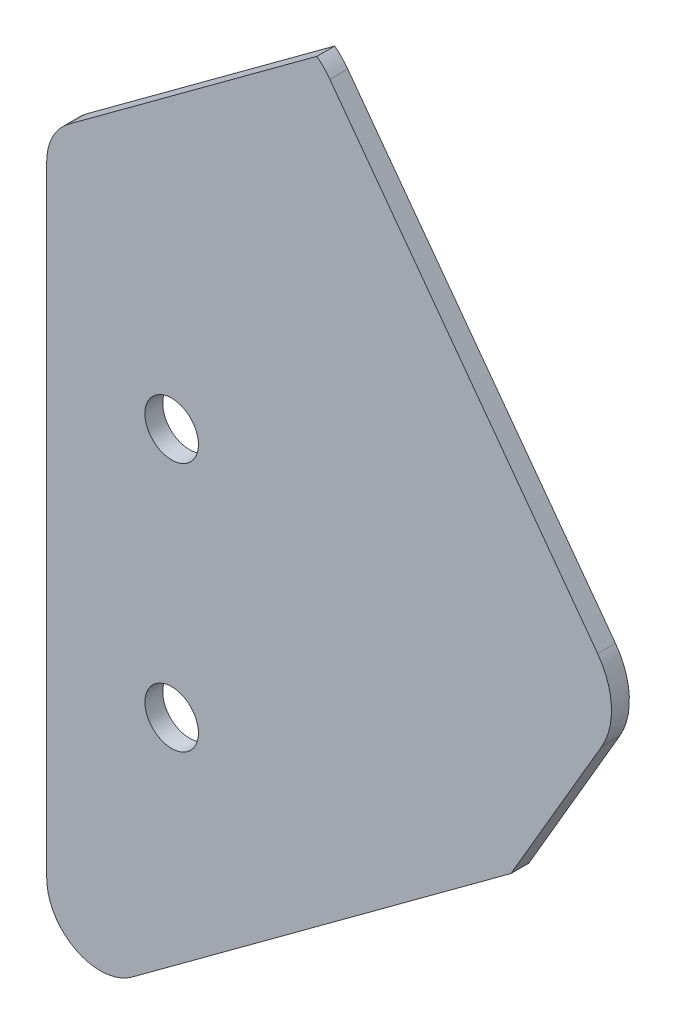
ISO-10303-21;
HEADER;
FILE_DESCRIPTION(('STEP AP214'),'2;1');
FILE_NAME('part.step','',(''),(''),'','','');
FILE_SCHEMA(('AUTOMOTIVE_DESIGN { 1 0 10303 214 1 1 1 1 }'));
ENDSEC;
DATA;
#1=APPLICATION_CONTEXT('core data for automotive mechanical design processes');
#2=APPLICATION_PROTOCOL_DEFINITION('international standard','automotive_design',2000,#1);
#3=PRODUCT_CONTEXT('',#1,'mechanical');
#4=PRODUCT('Part','Part','',(#3));
#5=PRODUCT_RELATED_PRODUCT_CATEGORY('part','',(#4));
#6=PRODUCT_DEFINITION_FORMATION('','',#4);
#7=PRODUCT_DEFINITION_CONTEXT('part definition',#1,'design');
#8=PRODUCT_DEFINITION('design','',#6,#7);
#9=PRODUCT_DEFINITION_SHAPE('','',#8);
#10=(LENGTH_UNIT() NAMED_UNIT(*) SI_UNIT(.MILLI.,.METRE.));
#11=(NAMED_UNIT(*) PLANE_ANGLE_UNIT() SI_UNIT($,.RADIAN.));
#12=(NAMED_UNIT(*) SI_UNIT($,.STERADIAN.) SOLID_ANGLE_UNIT());
#13=UNCERTAINTY_MEASURE_WITH_UNIT(LENGTH_MEASURE(1.E-05),#10,'distance_accuracy_value','');
#14=(GEOMETRIC_REPRESENTATION_CONTEXT(3) GLOBAL_UNCERTAINTY_ASSIGNED_CONTEXT((#13)) GLOBAL_UNIT_ASSIGNED_CONTEXT((#10,
#11,#12)) REPRESENTATION_CONTEXT('',''));
#15=CARTESIAN_POINT('',(0.,0.,0.));
#16=DIRECTION('',(0.,0.,1.));
#17=DIRECTION('',(1.,0.,0.));
#18=AXIS2_PLACEMENT_3D('',#15,#16,#17);
#19=CARTESIAN_POINT('',(-177.829938183927,241.418564799747,3.175));
#20=DIRECTION('',(0.593074905688179,-0.805147288539779,0.));
#21=DIRECTION('',(0.805147288539779,0.593074905688179,0.));
#22=AXIS2_PLACEMENT_3D('',#19,#20,#21);
#23=PLANE('',#22);
#24=DIRECTION('',(-0.805147288539779,-0.593074905688179,0.));
#25=VECTOR('',#24,1.);
#26=CARTESIAN_POINT('',(-177.829938183927,241.418564799747,0.));
#27=LINE('',#26,#25);
#28=CARTESIAN_POINT('',(61.4005319559519,417.636743182071,0.));
#29=VERTEX_POINT('',#28);
#30=CARTESIAN_POINT('',(17.2109615233494,385.086518285645,0.));
#31=VERTEX_POINT('',#30);
#32=EDGE_CURVE('E143',#29,#31,#27,.T.);
#33=ORIENTED_EDGE('',*,*,#32,.T.);
#34=DIRECTION('',(0.,0.,-1.));
#35=VECTOR('',#34,1.);
#36=CARTESIAN_POINT('',(17.2109615233494,385.086518285645,3.175));
#37=LINE('',#36,#35);
#38=CARTESIAN_POINT('',(17.2109615233494,385.086518285645,3.175));
#39=VERTEX_POINT('',#38);
#40=EDGE_CURVE('E11',#39,#31,#37,.T.);
#41=ORIENTED_EDGE('',*,*,#40,.F.);
#42=DIRECTION('',(-0.805147288539779,-0.593074905688179,0.));
#43=VECTOR('',#42,1.);
#44=CARTESIAN_POINT('',(-177.829938183927,241.418564799747,3.175));
#45=LINE('',#44,#43);
#46=CARTESIAN_POINT('',(61.4005319559519,417.636743182071,3.175));
#47=VERTEX_POINT('',#46);
#48=EDGE_CURVE('E200',#47,#39,#45,.T.);
#49=ORIENTED_EDGE('',*,*,#48,.F.);
#50=DIRECTION('',(0.,0.,-1.));
#51=VECTOR('',#50,1.);
#52=CARTESIAN_POINT('',(61.4005319559519,417.636743182071,3.175));
#53=LINE('',#52,#51);
#54=EDGE_CURVE('E133',#47,#29,#53,.T.);
#55=ORIENTED_EDGE('',*,*,#54,.T.);
#56=EDGE_LOOP('',(#33,#41,#49,#55));
#57=FACE_BOUND('',#56,.T.);
#58=ADVANCED_FACE('F36',(#57),#23,.F.);
#59=CARTESIAN_POINT('',(22.8600000000293,377.417490362304,3.175));
#60=DIRECTION('',(0.,0.,-1.));
#61=DIRECTION('',(-1.,0.,0.));
#62=AXIS2_PLACEMENT_3D('',#59,#60,#61);
#63=CYLINDRICAL_SURFACE('',#62,9.52500000000001);
#64=CARTESIAN_POINT('',(22.8600000000293,377.417490362304,0.));
#65=DIRECTION('',(0.,0.,1.));
#66=DIRECTION('',(1.,0.,0.));
#67=AXIS2_PLACEMENT_3D('',#64,#65,#66);
#68=CIRCLE('',#67,9.52500000000001);
#69=CARTESIAN_POINT('',(13.3350000000292,377.417490362304,0.));
#70=VERTEX_POINT('',#69);
#71=EDGE_CURVE('E146',#31,#70,#68,.T.);
#72=ORIENTED_EDGE('',*,*,#71,.T.);
#73=DIRECTION('',(0.,0.,-1.));
#74=VECTOR('',#73,1.);
#75=CARTESIAN_POINT('',(13.3350000000292,377.417490362304,3.175));
#76=LINE('',#75,#74);
#77=CARTESIAN_POINT('',(13.3350000000292,377.417490362304,3.175));
#78=VERTEX_POINT('',#77);
#79=EDGE_CURVE('E45',#78,#70,#76,.T.);
#80=ORIENTED_EDGE('',*,*,#79,.F.);
#81=CARTESIAN_POINT('',(22.8600000000293,377.417490362304,3.175));
#82=DIRECTION('',(0.,0.,1.));
#83=DIRECTION('',(1.,0.,0.));
#84=AXIS2_PLACEMENT_3D('',#81,#82,#83);
#85=CIRCLE('',#84,9.52500000000001);
#86=EDGE_CURVE('E95',#39,#78,#85,.T.);
#87=ORIENTED_EDGE('',*,*,#86,.F.);
#88=ORIENTED_EDGE('',*,*,#40,.T.);
#89=EDGE_LOOP('',(#72,#80,#87,#88));
#90=FACE_BOUND('',#89,.T.);
#91=ADVANCED_FACE('F228',(#90),#63,.T.);
#92=CARTESIAN_POINT('',(13.3350000000213,-2.7969075758601E-13,3.175));
#93=DIRECTION('',(1.,0.,0.));
#94=DIRECTION('',(0.,1.,0.));
#95=AXIS2_PLACEMENT_3D('',#92,#93,#94);
#96=PLANE('',#95);
#97=DIRECTION('',(0.,-1.,0.));
#98=VECTOR('',#97,1.);
#99=CARTESIAN_POINT('',(13.3350000000213,-2.7969075758601E-13,0.));
#100=LINE('',#99,#98);
#101=CARTESIAN_POINT('',(13.3350000000269,267.002909992505,0.));
#102=VERTEX_POINT('',#101);
#103=EDGE_CURVE('E148',#70,#102,#100,.T.);
#104=ORIENTED_EDGE('',*,*,#103,.T.);
#105=DIRECTION('',(0.,0.,-1.));
#106=VECTOR('',#105,1.);
#107=CARTESIAN_POINT('',(13.3350000000269,267.002909992505,3.175));
#108=LINE('',#107,#106);
#109=CARTESIAN_POINT('',(13.3350000000269,267.002909992505,3.175));
#110=VERTEX_POINT('',#109);
#111=EDGE_CURVE('E171',#110,#102,#108,.T.);
#112=ORIENTED_EDGE('',*,*,#111,.F.);
#113=DIRECTION('',(0.,-1.,0.));
#114=VECTOR('',#113,1.);
#115=CARTESIAN_POINT('',(13.3350000000213,-2.7969075758601E-13,3.175));
#116=LINE('',#115,#114);
#117=EDGE_CURVE('E179',#78,#110,#116,.T.);
#118=ORIENTED_EDGE('',*,*,#117,.F.);
#119=ORIENTED_EDGE('',*,*,#79,.T.);
#120=EDGE_LOOP('',(#104,#112,#118,#119));
#121=FACE_BOUND('',#120,.T.);
#122=ADVANCED_FACE('F177',(#121),#96,.F.);
#123=CARTESIAN_POINT('',(22.8600000000269,267.002909992505,3.175));
#124=DIRECTION('',(0.,0.,-1.));
#125=DIRECTION('',(-1.,0.,0.));
#126=AXIS2_PLACEMENT_3D('',#123,#124,#125);
#127=CYLINDRICAL_SURFACE('',#126,9.52500000000002);
#128=CARTESIAN_POINT('',(22.8600000000269,267.002909992505,0.));
#129=DIRECTION('',(0.,0.,1.));
#130=DIRECTION('',(1.,0.,0.));
#131=AXIS2_PLACEMENT_3D('',#128,#129,#130);
#132=CIRCLE('',#131,9.52500000000002);
#133=CARTESIAN_POINT('',(28.5090384767069,259.333882069163,0.));
#134=VERTEX_POINT('',#133);
#135=EDGE_CURVE('E150',#102,#134,#132,.T.);
#136=ORIENTED_EDGE('',*,*,#135,.T.);
#137=DIRECTION('',(0.,0.,-1.));
#138=VECTOR('',#137,1.);
#139=CARTESIAN_POINT('',(28.5090384767069,259.333882069163,3.175));
#140=LINE('',#139,#138);
#141=CARTESIAN_POINT('',(28.5090384767069,259.333882069163,3.175));
#142=VERTEX_POINT('',#141);
#143=EDGE_CURVE('E168',#142,#134,#140,.T.);
#144=ORIENTED_EDGE('',*,*,#143,.F.);
#145=CARTESIAN_POINT('',(22.8600000000269,267.002909992505,3.175));
#146=DIRECTION('',(0.,0.,1.));
#147=DIRECTION('',(1.,0.,0.));
#148=AXIS2_PLACEMENT_3D('',#145,#146,#147);
#149=CIRCLE('',#148,9.52500000000002);
#150=EDGE_CURVE('E194',#110,#142,#149,.T.);
#151=ORIENTED_EDGE('',*,*,#150,.F.);
#152=ORIENTED_EDGE('',*,*,#111,.T.);
#153=EDGE_LOOP('',(#136,#144,#151,#152));
#154=FACE_BOUND('',#153,.T.);
#155=ADVANCED_FACE('F187',(#154),#127,.T.);
#156=CARTESIAN_POINT('',(-113.807502114888,154.502915001877,3.175));
#157=DIRECTION('',(-0.593074905688179,0.805147288539779,0.));
#158=DIRECTION('',(-0.805147288539779,-0.593074905688179,0.));
#159=AXIS2_PLACEMENT_3D('',#156,#157,#158);
#160=PLANE('',#159);
#161=DIRECTION('',(0.805147288539779,0.593074905688179,0.));
#162=VECTOR('',#161,1.);
#163=CARTESIAN_POINT('',(-113.807502114888,154.502915001877,0.));
#164=LINE('',#163,#162);
#165=CARTESIAN_POINT('',(95.9084346104475,308.980562961492,0.));
#166=VERTEX_POINT('',#165);
#167=EDGE_CURVE('E152',#134,#166,#164,.T.);
#168=ORIENTED_EDGE('',*,*,#167,.T.);
#169=DIRECTION('',(0.,0.,-1.));
#170=VECTOR('',#169,1.);
#171=CARTESIAN_POINT('',(95.9084346104475,308.980562961492,3.175));
#172=LINE('',#171,#170);
#173=CARTESIAN_POINT('',(95.9084346104475,308.980562961492,3.175));
#174=VERTEX_POINT('',#173);
#175=EDGE_CURVE('E166',#174,#166,#172,.T.);
#176=ORIENTED_EDGE('',*,*,#175,.F.);
#177=DIRECTION('',(0.805147288539779,0.593074905688179,0.));
#178=VECTOR('',#177,1.);
#179=CARTESIAN_POINT('',(-113.807502114888,154.502915001877,3.175));
#180=LINE('',#179,#178);
#181=EDGE_CURVE('E193',#142,#174,#180,.T.);
#182=ORIENTED_EDGE('',*,*,#181,.F.);
#183=ORIENTED_EDGE('',*,*,#143,.T.);
#184=EDGE_LOOP('',(#168,#176,#182,#183));
#185=FACE_BOUND('',#184,.T.);
#186=ADVANCED_FACE('F191',(#185),#160,.F.);
#187=CARTESIAN_POINT('',(-63.0827316515713,36.8567403637548,3.175));
#188=DIRECTION('',(0.863430318721118,-0.504468120611351,0.));
#189=DIRECTION('',(0.504468120611351,0.863430318721118,0.));
#190=AXIS2_PLACEMENT_3D('',#187,#188,#189);
#191=PLANE('',#190);
#192=DIRECTION('',(-0.504468120611351,-0.863430318721118,0.));
#193=VECTOR('',#192,1.);
#194=CARTESIAN_POINT('',(-63.0827316515713,36.8567403637548,0.));
#195=LINE('',#194,#193);
#196=CARTESIAN_POINT('',(112.073002649114,336.647282746878,0.));
#197=VERTEX_POINT('',#196);
#198=EDGE_CURVE('E155',#197,#166,#195,.T.);
#199=ORIENTED_EDGE('',*,*,#198,.F.);
#200=DIRECTION('',(0.,0.,-1.));
#201=VECTOR('',#200,1.);
#202=CARTESIAN_POINT('',(112.073002649114,336.647282746878,3.175));
#203=LINE('',#202,#201);
#204=CARTESIAN_POINT('',(112.073002649114,336.647282746878,3.175));
#205=VERTEX_POINT('',#204);
#206=EDGE_CURVE('E129',#205,#197,#203,.T.);
#207=ORIENTED_EDGE('',*,*,#206,.F.);
#208=DIRECTION('',(-0.504468120611351,-0.863430318721118,0.));
#209=VECTOR('',#208,1.);
#210=CARTESIAN_POINT('',(-63.0827316515713,36.8567403637548,3.175));
#211=LINE('',#210,#209);
#212=EDGE_CURVE('E118',#205,#174,#211,.T.);
#213=ORIENTED_EDGE('',*,*,#212,.T.);
#214=ORIENTED_EDGE('',*,*,#175,.T.);
#215=EDGE_LOOP('',(#199,#207,#213,#214));
#216=FACE_BOUND('',#215,.T.);
#217=ADVANCED_FACE('F242',(#216),#191,.T.);
#218=CARTESIAN_POINT('',(101.107437601355,343.054027878642,3.175));
#219=DIRECTION('',(0.,0.,-1.));
#220=DIRECTION('',(-1.,0.,0.));
#221=AXIS2_PLACEMENT_3D('',#218,#219,#220);
#222=CYLINDRICAL_SURFACE('',#221,12.7);
#223=CARTESIAN_POINT('',(101.107437601355,343.054027878642,0.));
#224=DIRECTION('',(0.,0.,1.));
#225=DIRECTION('',(1.,0.,0.));
#226=AXIS2_PLACEMENT_3D('',#223,#224,#225);
#227=CIRCLE('',#226,12.7);
#228=CARTESIAN_POINT('',(111.33280816581,350.586079180882,0.));
#229=VERTEX_POINT('',#228);
#230=EDGE_CURVE('E125',#197,#229,#227,.T.);
#231=ORIENTED_EDGE('',*,*,#230,.T.);
#232=DIRECTION('',(0.,0.,-1.));
#233=VECTOR('',#232,1.);
#234=CARTESIAN_POINT('',(111.33280816581,350.586079180882,3.175));
#235=LINE('',#234,#233);
#236=CARTESIAN_POINT('',(111.33280816581,350.586079180882,3.175));
#237=VERTEX_POINT('',#236);
#238=EDGE_CURVE('E122',#237,#229,#235,.T.);
#239=ORIENTED_EDGE('',*,*,#238,.F.);
#240=CARTESIAN_POINT('',(101.107437601355,343.054027878642,3.175));
#241=DIRECTION('',(0.,0.,1.));
#242=DIRECTION('',(1.,0.,0.));
#243=AXIS2_PLACEMENT_3D('',#240,#241,#242);
#244=CIRCLE('',#243,12.7);
#245=EDGE_CURVE('E112',#205,#237,#244,.T.);
#246=ORIENTED_EDGE('',*,*,#245,.F.);
#247=ORIENTED_EDGE('',*,*,#206,.T.);
#248=EDGE_LOOP('',(#231,#239,#246,#247));
#249=FACE_BOUND('',#248,.T.);
#250=ADVANCED_FACE('F123',(#249),#222,.T.);
#251=CARTESIAN_POINT('',(239.582134781761,176.477216048207,3.175));
#252=DIRECTION('',(0.805147288539785,0.59307490568817,0.));
#253=DIRECTION('',(-0.59307490568817,0.805147288539785,0.));
#254=AXIS2_PLACEMENT_3D('',#251,#252,#253);
#255=PLANE('',#254);
#256=DIRECTION('',(0.59307490568817,-0.805147288539785,0.));
#257=VECTOR('',#256,1.);
#258=CARTESIAN_POINT('',(239.582134781761,176.477216048207,0.));
#259=LINE('',#258,#257);
#260=CARTESIAN_POINT('',(63.7105299364164,415.237184501201,0.));
#261=VERTEX_POINT('',#260);
#262=EDGE_CURVE('E159',#261,#229,#259,.T.);
#263=ORIENTED_EDGE('',*,*,#262,.F.);
#264=DIRECTION('',(0.,0.,-1.));
#265=VECTOR('',#264,1.);
#266=CARTESIAN_POINT('',(63.7105299364164,415.237184501201,3.175));
#267=LINE('',#266,#265);
#268=CARTESIAN_POINT('',(63.7105299364164,415.237184501201,3.175));
#269=VERTEX_POINT('',#268);
#270=EDGE_CURVE('E84',#269,#261,#267,.T.);
#271=ORIENTED_EDGE('',*,*,#270,.F.);
#272=DIRECTION('',(0.59307490568817,-0.805147288539785,0.));
#273=VECTOR('',#272,1.);
#274=CARTESIAN_POINT('',(239.582134781761,176.477216048207,3.175));
#275=LINE('',#274,#273);
#276=EDGE_CURVE('E116',#269,#237,#275,.T.);
#277=ORIENTED_EDGE('',*,*,#276,.T.);
#278=ORIENTED_EDGE('',*,*,#238,.T.);
#279=EDGE_LOOP('',(#263,#271,#277,#278));
#280=FACE_BOUND('',#279,.T.);
#281=ADVANCED_FACE('F131',(#280),#255,.T.);
#282=CARTESIAN_POINT('',(35.5600000000281,302.837639338046,3.175));
#283=DIRECTION('',(0.,0.,-1.));
#284=DIRECTION('',(-1.,0.,0.));
#285=AXIS2_PLACEMENT_3D('',#282,#283,#284);
#286=CYLINDRICAL_SURFACE('',#285,4.76249999999627);
#287=CARTESIAN_POINT('',(35.5600000000281,302.837639338046,3.175));
#288=DIRECTION('',(0.,0.,1.));
#289=DIRECTION('',(1.,0.,0.));
#290=AXIS2_PLACEMENT_3D('',#287,#288,#289);
#291=CIRCLE('',#290,4.76249999999627);
#292=CARTESIAN_POINT('',(40.3225000000244,302.837639338046,3.175));
#293=VERTEX_POINT('',#292);
#294=EDGE_CURVE('E202',#293,#293,#291,.T.);
#295=ORIENTED_EDGE('',*,*,#294,.T.);
#296=EDGE_LOOP('',(#295));
#297=FACE_BOUND('',#296,.T.);
#298=CARTESIAN_POINT('',(35.5600000000281,302.837639338046,0.));
#299=DIRECTION('',(0.,0.,1.));
#300=DIRECTION('',(1.,0.,0.));
#301=AXIS2_PLACEMENT_3D('',#298,#299,#300);
#302=CIRCLE('',#301,4.76249999999627);
#303=CARTESIAN_POINT('',(40.3225000000244,302.837639338046,0.));
#304=VERTEX_POINT('',#303);
#305=EDGE_CURVE('E140',#304,#304,#302,.T.);
#306=ORIENTED_EDGE('',*,*,#305,.F.);
#307=EDGE_LOOP('',(#306));
#308=FACE_BOUND('',#307,.T.);
#309=ADVANCED_FACE('F216',(#297,#308),#286,.F.);
#310=CARTESIAN_POINT('',(35.5600000000289,347.287639338046,3.175));
#311=DIRECTION('',(0.,0.,-1.));
#312=DIRECTION('',(-1.,0.,0.));
#313=AXIS2_PLACEMENT_3D('',#310,#311,#312);
#314=CYLINDRICAL_SURFACE('',#313,4.7625000000069);
#315=CARTESIAN_POINT('',(35.5600000000289,347.287639338046,3.175));
#316=DIRECTION('',(0.,0.,1.));
#317=DIRECTION('',(1.,0.,0.));
#318=AXIS2_PLACEMENT_3D('',#315,#316,#317);
#319=CIRCLE('',#318,4.7625000000069);
#320=CARTESIAN_POINT('',(40.3225000000358,347.287639338046,3.175));
#321=VERTEX_POINT('',#320);
#322=EDGE_CURVE('E162',#321,#321,#319,.T.);
#323=ORIENTED_EDGE('',*,*,#322,.T.);
#324=EDGE_LOOP('',(#323));
#325=FACE_BOUND('',#324,.T.);
#326=CARTESIAN_POINT('',(35.5600000000289,347.287639338046,0.));
#327=DIRECTION('',(0.,0.,1.));
#328=DIRECTION('',(1.,0.,0.));
#329=AXIS2_PLACEMENT_3D('',#326,#327,#328);
#330=CIRCLE('',#329,4.7625000000069);
#331=CARTESIAN_POINT('',(40.3225000000358,347.287639338046,0.));
#332=VERTEX_POINT('',#331);
#333=EDGE_CURVE('E137',#332,#332,#330,.T.);
#334=ORIENTED_EDGE('',*,*,#333,.F.);
#335=EDGE_LOOP('',(#334));
#336=FACE_BOUND('',#335,.T.);
#337=ADVANCED_FACE('F38',(#325,#336),#314,.F.);
#338=CARTESIAN_POINT('',(53.485159371961,407.705133198961,3.175));
#339=DIRECTION('',(0.,0.,-1.));
#340=DIRECTION('',(-1.,0.,0.));
#341=AXIS2_PLACEMENT_3D('',#338,#339,#340);
#342=CYLINDRICAL_SURFACE('',#341,12.7);
#343=CARTESIAN_POINT('',(53.485159371961,407.705133198961,0.));
#344=DIRECTION('',(0.,0.,1.));
#345=DIRECTION('',(1.,0.,0.));
#346=AXIS2_PLACEMENT_3D('',#343,#344,#345);
#347=CIRCLE('',#346,12.7);
#348=EDGE_CURVE('E87',#261,#29,#347,.T.);
#349=ORIENTED_EDGE('',*,*,#348,.T.);
#350=ORIENTED_EDGE('',*,*,#54,.F.);
#351=CARTESIAN_POINT('',(53.485159371961,407.705133198961,3.175));
#352=DIRECTION('',(0.,0.,1.));
#353=DIRECTION('',(1.,0.,0.));
#354=AXIS2_PLACEMENT_3D('',#351,#352,#353);
#355=CIRCLE('',#354,12.7);
#356=EDGE_CURVE('E53',#269,#47,#355,.T.);
#357=ORIENTED_EDGE('',*,*,#356,.F.);
#358=ORIENTED_EDGE('',*,*,#270,.T.);
#359=EDGE_LOOP('',(#349,#350,#357,#358));
#360=FACE_BOUND('',#359,.T.);
#361=ADVANCED_FACE('F212',(#360),#342,.T.);
#362=CARTESIAN_POINT('',(0.,0.,3.175));
#363=DIRECTION('',(0.,0.,1.));
#364=DIRECTION('',(1.,0.,0.));
#365=AXIS2_PLACEMENT_3D('',#362,#363,#364);
#366=PLANE('',#365);
#367=ORIENTED_EDGE('',*,*,#322,.F.);
#368=EDGE_LOOP('',(#367));
#369=FACE_BOUND('',#368,.T.);
#370=ORIENTED_EDGE('',*,*,#294,.F.);
#371=EDGE_LOOP('',(#370));
#372=FACE_BOUND('',#371,.T.);
#373=ORIENTED_EDGE('',*,*,#48,.T.);
#374=ORIENTED_EDGE('',*,*,#86,.T.);
#375=ORIENTED_EDGE('',*,*,#117,.T.);
#376=ORIENTED_EDGE('',*,*,#150,.T.);
#377=ORIENTED_EDGE('',*,*,#181,.T.);
#378=ORIENTED_EDGE('',*,*,#212,.F.);
#379=ORIENTED_EDGE('',*,*,#245,.T.);
#380=ORIENTED_EDGE('',*,*,#276,.F.);
#381=ORIENTED_EDGE('',*,*,#356,.T.);
#382=EDGE_LOOP('',(#373,#374,#375,#376,#377,#378,#379,#380,#381));
#383=FACE_BOUND('',#382,.T.);
#384=ADVANCED_FACE('F114',(#369,#372,#383),#366,.T.);
#385=CARTESIAN_POINT('',(0.,0.,0.));
#386=DIRECTION('',(0.,0.,1.));
#387=DIRECTION('',(1.,0.,0.));
#388=AXIS2_PLACEMENT_3D('',#385,#386,#387);
#389=PLANE('',#388);
#390=ORIENTED_EDGE('',*,*,#333,.T.);
#391=EDGE_LOOP('',(#390));
#392=FACE_BOUND('',#391,.T.);
#393=ORIENTED_EDGE('',*,*,#305,.T.);
#394=EDGE_LOOP('',(#393));
#395=FACE_BOUND('',#394,.T.);
#396=ORIENTED_EDGE('',*,*,#32,.F.);
#397=ORIENTED_EDGE('',*,*,#348,.F.);
#398=ORIENTED_EDGE('',*,*,#262,.T.);
#399=ORIENTED_EDGE('',*,*,#230,.F.);
#400=ORIENTED_EDGE('',*,*,#198,.T.);
#401=ORIENTED_EDGE('',*,*,#167,.F.);
#402=ORIENTED_EDGE('',*,*,#135,.F.);
#403=ORIENTED_EDGE('',*,*,#103,.F.);
#404=ORIENTED_EDGE('',*,*,#71,.F.);
#405=EDGE_LOOP('',(#396,#397,#398,#399,#400,#401,#402,#403,#404));
#406=FACE_BOUND('',#405,.T.);
#407=ADVANCED_FACE('F183',(#392,#395,#406),#389,.F.);
#408=CLOSED_SHELL('',(#58,#91,#122,#155,#186,#217,#250,#281,#309,#337,#361,#384,#407));
#409=MANIFOLD_SOLID_BREP('B2',#408);
#410=ADVANCED_BREP_SHAPE_REPRESENTATION('',(#18,#409),#14);
#411=SHAPE_DEFINITION_REPRESENTATION(#9,#410);
ENDSEC;
END-ISO-10303-21;
